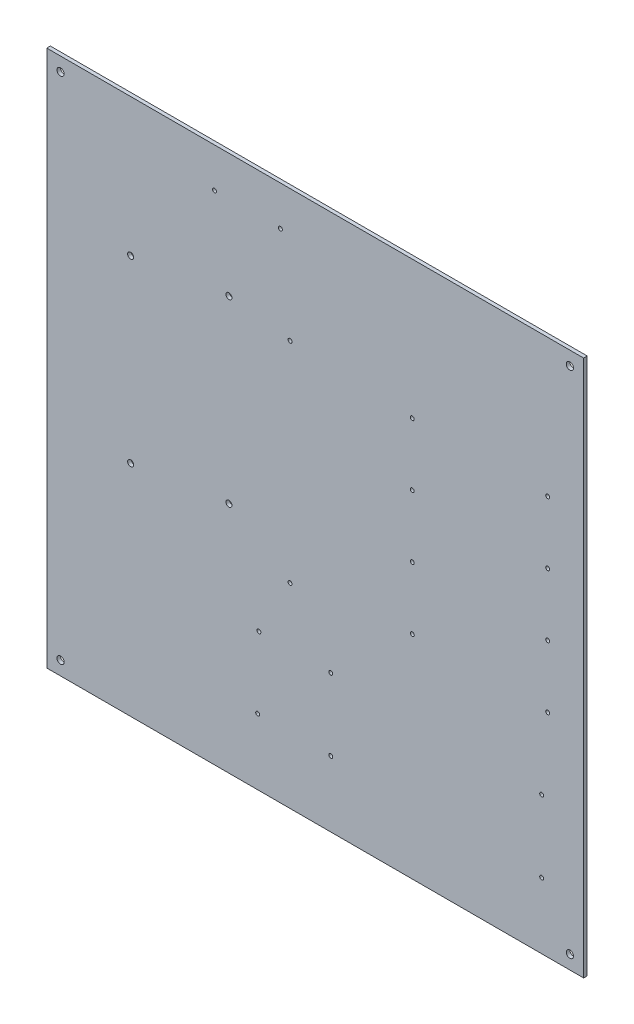
ISO-10303-21;
HEADER;
FILE_DESCRIPTION(('STEP AP214'),'2;1');
FILE_NAME('part.step','',(''),(''),'','','');
FILE_SCHEMA(('AUTOMOTIVE_DESIGN { 1 0 10303 214 1 1 1 1 }'));
ENDSEC;
DATA;
#1=APPLICATION_CONTEXT('core data for automotive mechanical design processes');
#2=APPLICATION_PROTOCOL_DEFINITION('international standard','automotive_design',2000,#1);
#3=PRODUCT_CONTEXT('',#1,'mechanical');
#4=PRODUCT('Part','Part','',(#3));
#5=PRODUCT_RELATED_PRODUCT_CATEGORY('part','',(#4));
#6=PRODUCT_DEFINITION_FORMATION('','',#4);
#7=PRODUCT_DEFINITION_CONTEXT('part definition',#1,'design');
#8=PRODUCT_DEFINITION('design','',#6,#7);
#9=PRODUCT_DEFINITION_SHAPE('','',#8);
#10=(LENGTH_UNIT() NAMED_UNIT(*) SI_UNIT(.MILLI.,.METRE.));
#11=(NAMED_UNIT(*) PLANE_ANGLE_UNIT() SI_UNIT($,.RADIAN.));
#12=(NAMED_UNIT(*) SI_UNIT($,.STERADIAN.) SOLID_ANGLE_UNIT());
#13=UNCERTAINTY_MEASURE_WITH_UNIT(LENGTH_MEASURE(1.E-05),#10,'distance_accuracy_value','');
#14=(GEOMETRIC_REPRESENTATION_CONTEXT(3) GLOBAL_UNCERTAINTY_ASSIGNED_CONTEXT((#13)) GLOBAL_UNIT_ASSIGNED_CONTEXT((#10,
#11,#12)) REPRESENTATION_CONTEXT('',''));
#15=CARTESIAN_POINT('',(0.,0.,0.));
#16=DIRECTION('',(0.,0.,1.));
#17=DIRECTION('',(1.,0.,0.));
#18=AXIS2_PLACEMENT_3D('',#15,#16,#17);
#19=CARTESIAN_POINT('',(0.,0.,-3.));
#20=DIRECTION('',(-1.,0.,0.));
#21=DIRECTION('',(0.,0.,1.));
#22=AXIS2_PLACEMENT_3D('',#19,#20,#21);
#23=PLANE('',#22);
#24=DIRECTION('',(0.,-1.,0.));
#25=VECTOR('',#24,1.);
#26=CARTESIAN_POINT('',(0.,0.,0.));
#27=LINE('',#26,#25);
#28=CARTESIAN_POINT('',(0.,448.,0.));
#29=VERTEX_POINT('',#28);
#30=CARTESIAN_POINT('',(0.,0.,0.));
#31=VERTEX_POINT('',#30);
#32=EDGE_CURVE('E98',#29,#31,#27,.T.);
#33=ORIENTED_EDGE('',*,*,#32,.F.);
#34=DIRECTION('',(0.,0.,1.));
#35=VECTOR('',#34,1.);
#36=CARTESIAN_POINT('',(0.,448.,-3.));
#37=LINE('',#36,#35);
#38=CARTESIAN_POINT('',(0.,448.,-3.));
#39=VERTEX_POINT('',#38);
#40=EDGE_CURVE('E11',#39,#29,#37,.T.);
#41=ORIENTED_EDGE('',*,*,#40,.F.);
#42=DIRECTION('',(0.,-1.,0.));
#43=VECTOR('',#42,1.);
#44=CARTESIAN_POINT('',(0.,0.,-3.));
#45=LINE('',#44,#43);
#46=CARTESIAN_POINT('',(0.,0.,-3.));
#47=VERTEX_POINT('',#46);
#48=EDGE_CURVE('E91',#39,#47,#45,.T.);
#49=ORIENTED_EDGE('',*,*,#48,.T.);
#50=DIRECTION('',(0.,0.,1.));
#51=VECTOR('',#50,1.);
#52=CARTESIAN_POINT('',(0.,0.,-3.));
#53=LINE('',#52,#51);
#54=EDGE_CURVE('E36',#47,#31,#53,.T.);
#55=ORIENTED_EDGE('',*,*,#54,.T.);
#56=EDGE_LOOP('',(#33,#41,#49,#55));
#57=FACE_BOUND('',#56,.T.);
#58=ADVANCED_FACE('F33',(#57),#23,.T.);
#59=CARTESIAN_POINT('',(0.,448.,-3.));
#60=DIRECTION('',(0.,1.,0.));
#61=DIRECTION('',(0.,0.,1.));
#62=AXIS2_PLACEMENT_3D('',#59,#60,#61);
#63=PLANE('',#62);
#64=DIRECTION('',(-1.,0.,0.));
#65=VECTOR('',#64,1.);
#66=CARTESIAN_POINT('',(0.,448.,0.));
#67=LINE('',#66,#65);
#68=CARTESIAN_POINT('',(448.,448.,0.));
#69=VERTEX_POINT('',#68);
#70=EDGE_CURVE('E93',#69,#29,#67,.T.);
#71=ORIENTED_EDGE('',*,*,#70,.F.);
#72=DIRECTION('',(0.,0.,1.));
#73=VECTOR('',#72,1.);
#74=CARTESIAN_POINT('',(448.,448.,-3.));
#75=LINE('',#74,#73);
#76=CARTESIAN_POINT('',(448.,448.,-3.));
#77=VERTEX_POINT('',#76);
#78=EDGE_CURVE('E42',#77,#69,#75,.T.);
#79=ORIENTED_EDGE('',*,*,#78,.F.);
#80=DIRECTION('',(-1.,0.,0.));
#81=VECTOR('',#80,1.);
#82=CARTESIAN_POINT('',(0.,448.,-3.));
#83=LINE('',#82,#81);
#84=EDGE_CURVE('E88',#77,#39,#83,.T.);
#85=ORIENTED_EDGE('',*,*,#84,.T.);
#86=ORIENTED_EDGE('',*,*,#40,.T.);
#87=EDGE_LOOP('',(#71,#79,#85,#86));
#88=FACE_BOUND('',#87,.T.);
#89=ADVANCED_FACE('F109',(#88),#63,.T.);
#90=CARTESIAN_POINT('',(448.,0.,-3.));
#91=DIRECTION('',(1.,0.,0.));
#92=DIRECTION('',(0.,0.,-1.));
#93=AXIS2_PLACEMENT_3D('',#90,#91,#92);
#94=PLANE('',#93);
#95=DIRECTION('',(0.,1.,0.));
#96=VECTOR('',#95,1.);
#97=CARTESIAN_POINT('',(448.,0.,0.));
#98=LINE('',#97,#96);
#99=CARTESIAN_POINT('',(448.,0.,0.));
#100=VERTEX_POINT('',#99);
#101=EDGE_CURVE('E83',#100,#69,#98,.T.);
#102=ORIENTED_EDGE('',*,*,#101,.F.);
#103=DIRECTION('',(0.,0.,1.));
#104=VECTOR('',#103,1.);
#105=CARTESIAN_POINT('',(448.,0.,-3.));
#106=LINE('',#105,#104);
#107=CARTESIAN_POINT('',(448.,0.,-3.));
#108=VERTEX_POINT('',#107);
#109=EDGE_CURVE('E78',#108,#100,#106,.T.);
#110=ORIENTED_EDGE('',*,*,#109,.F.);
#111=DIRECTION('',(0.,1.,0.));
#112=VECTOR('',#111,1.);
#113=CARTESIAN_POINT('',(448.,0.,-3.));
#114=LINE('',#113,#112);
#115=EDGE_CURVE('E81',#108,#77,#114,.T.);
#116=ORIENTED_EDGE('',*,*,#115,.T.);
#117=ORIENTED_EDGE('',*,*,#78,.T.);
#118=EDGE_LOOP('',(#102,#110,#116,#117));
#119=FACE_BOUND('',#118,.T.);
#120=ADVANCED_FACE('F80',(#119),#94,.T.);
#121=CARTESIAN_POINT('',(0.,0.,-3.));
#122=DIRECTION('',(0.,-1.,0.));
#123=DIRECTION('',(0.,0.,-1.));
#124=AXIS2_PLACEMENT_3D('',#121,#122,#123);
#125=PLANE('',#124);
#126=DIRECTION('',(1.,0.,0.));
#127=VECTOR('',#126,1.);
#128=CARTESIAN_POINT('',(0.,0.,0.));
#129=LINE('',#128,#127);
#130=EDGE_CURVE('E101',#31,#100,#129,.T.);
#131=ORIENTED_EDGE('',*,*,#130,.F.);
#132=ORIENTED_EDGE('',*,*,#54,.F.);
#133=DIRECTION('',(1.,0.,0.));
#134=VECTOR('',#133,1.);
#135=CARTESIAN_POINT('',(0.,0.,-3.));
#136=LINE('',#135,#134);
#137=EDGE_CURVE('E87',#47,#108,#136,.T.);
#138=ORIENTED_EDGE('',*,*,#137,.T.);
#139=ORIENTED_EDGE('',*,*,#109,.T.);
#140=EDGE_LOOP('',(#131,#132,#138,#139));
#141=FACE_BOUND('',#140,.T.);
#142=ADVANCED_FACE('F90',(#141),#125,.T.);
#143=CARTESIAN_POINT('',(0.,0.,-3.));
#144=DIRECTION('',(0.,0.,-1.));
#145=DIRECTION('',(-1.,0.,0.));
#146=AXIS2_PLACEMENT_3D('',#143,#144,#145);
#147=PLANE('',#146);
#148=CARTESIAN_POINT('',(413.,55.,-3.));
#149=DIRECTION('',(0.,0.,1.));
#150=DIRECTION('',(1.,0.,0.));
#151=AXIS2_PLACEMENT_3D('',#148,#149,#150);
#152=CIRCLE('',#151,1.64999999999999);
#153=CARTESIAN_POINT('',(414.65,55.,-3.));
#154=VERTEX_POINT('',#153);
#155=EDGE_CURVE('E238',#154,#154,#152,.T.);
#156=ORIENTED_EDGE('',*,*,#155,.T.);
#157=EDGE_LOOP('',(#156));
#158=FACE_BOUND('',#157,.T.);
#159=CARTESIAN_POINT('',(413.,115.,-3.));
#160=DIRECTION('',(0.,0.,1.));
#161=DIRECTION('',(1.,0.,0.));
#162=AXIS2_PLACEMENT_3D('',#159,#160,#161);
#163=CIRCLE('',#162,1.64999999999999);
#164=CARTESIAN_POINT('',(414.65,115.,-3.));
#165=VERTEX_POINT('',#164);
#166=EDGE_CURVE('E246',#165,#165,#163,.T.);
#167=ORIENTED_EDGE('',*,*,#166,.T.);
#168=EDGE_LOOP('',(#167));
#169=FACE_BOUND('',#168,.T.);
#170=CARTESIAN_POINT('',(237.,115.,-3.));
#171=DIRECTION('',(0.,0.,1.));
#172=DIRECTION('',(1.,0.,0.));
#173=AXIS2_PLACEMENT_3D('',#170,#171,#172);
#174=CIRCLE('',#173,1.65000000000002);
#175=CARTESIAN_POINT('',(238.65,115.,-3.));
#176=VERTEX_POINT('',#175);
#177=EDGE_CURVE('E252',#176,#176,#174,.T.);
#178=ORIENTED_EDGE('',*,*,#177,.T.);
#179=EDGE_LOOP('',(#178));
#180=FACE_BOUND('',#179,.T.);
#181=CARTESIAN_POINT('',(237.,55.,-3.));
#182=DIRECTION('',(0.,0.,1.));
#183=DIRECTION('',(1.,0.,0.));
#184=AXIS2_PLACEMENT_3D('',#181,#182,#183);
#185=CIRCLE('',#184,1.65000000000002);
#186=CARTESIAN_POINT('',(238.65,55.,-3.));
#187=VERTEX_POINT('',#186);
#188=EDGE_CURVE('E258',#187,#187,#185,.T.);
#189=ORIENTED_EDGE('',*,*,#188,.T.);
#190=EDGE_LOOP('',(#189));
#191=FACE_BOUND('',#190,.T.);
#192=CARTESIAN_POINT('',(176.,55.,-3.));
#193=DIRECTION('',(0.,0.,1.));
#194=DIRECTION('',(1.,0.,0.));
#195=AXIS2_PLACEMENT_3D('',#192,#193,#194);
#196=CIRCLE('',#195,1.65000000000002);
#197=CARTESIAN_POINT('',(177.65,55.,-3.));
#198=VERTEX_POINT('',#197);
#199=EDGE_CURVE('E264',#198,#198,#196,.T.);
#200=ORIENTED_EDGE('',*,*,#199,.T.);
#201=EDGE_LOOP('',(#200));
#202=FACE_BOUND('',#201,.T.);
#203=CARTESIAN_POINT('',(177.,115.,-3.));
#204=DIRECTION('',(0.,0.,1.));
#205=DIRECTION('',(1.,0.,0.));
#206=AXIS2_PLACEMENT_3D('',#203,#204,#205);
#207=CIRCLE('',#206,1.65000000000002);
#208=CARTESIAN_POINT('',(178.65,115.,-3.));
#209=VERTEX_POINT('',#208);
#210=EDGE_CURVE('E270',#209,#209,#207,.T.);
#211=ORIENTED_EDGE('',*,*,#210,.T.);
#212=EDGE_LOOP('',(#211));
#213=FACE_BOUND('',#212,.T.);
#214=CARTESIAN_POINT('',(203.,163.,-3.));
#215=DIRECTION('',(0.,0.,1.));
#216=DIRECTION('',(1.,0.,0.));
#217=AXIS2_PLACEMENT_3D('',#214,#215,#216);
#218=CIRCLE('',#217,1.65000000000002);
#219=CARTESIAN_POINT('',(204.65,163.,-3.));
#220=VERTEX_POINT('',#219);
#221=EDGE_CURVE('E276',#220,#220,#218,.T.);
#222=ORIENTED_EDGE('',*,*,#221,.T.);
#223=EDGE_LOOP('',(#222));
#224=FACE_BOUND('',#223,.T.);
#225=CARTESIAN_POINT('',(203.,338.,-3.));
#226=DIRECTION('',(0.,0.,1.));
#227=DIRECTION('',(1.,0.,0.));
#228=AXIS2_PLACEMENT_3D('',#225,#226,#227);
#229=CIRCLE('',#228,1.65000000000002);
#230=CARTESIAN_POINT('',(204.65,338.,-3.));
#231=VERTEX_POINT('',#230);
#232=EDGE_CURVE('E282',#231,#231,#229,.T.);
#233=ORIENTED_EDGE('',*,*,#232,.T.);
#234=EDGE_LOOP('',(#233));
#235=FACE_BOUND('',#234,.T.);
#236=CARTESIAN_POINT('',(152.,194.7695894105,-3.));
#237=DIRECTION('',(0.,0.,1.));
#238=DIRECTION('',(1.,0.,0.));
#239=AXIS2_PLACEMENT_3D('',#236,#237,#238);
#240=CIRCLE('',#239,2.5);
#241=CARTESIAN_POINT('',(154.5,194.7695894105,-3.));
#242=VERTEX_POINT('',#241);
#243=EDGE_CURVE('E288',#242,#242,#240,.T.);
#244=ORIENTED_EDGE('',*,*,#243,.T.);
#245=EDGE_LOOP('',(#244));
#246=FACE_BOUND('',#245,.T.);
#247=CARTESIAN_POINT('',(152.,344.7695894105,-3.));
#248=DIRECTION('',(0.,0.,1.));
#249=DIRECTION('',(1.,0.,0.));
#250=AXIS2_PLACEMENT_3D('',#247,#248,#249);
#251=CIRCLE('',#250,2.5);
#252=CARTESIAN_POINT('',(154.5,344.7695894105,-3.));
#253=VERTEX_POINT('',#252);
#254=EDGE_CURVE('E294',#253,#253,#251,.T.);
#255=ORIENTED_EDGE('',*,*,#254,.T.);
#256=EDGE_LOOP('',(#255));
#257=FACE_BOUND('',#256,.T.);
#258=CARTESIAN_POINT('',(70.,183.,-3.));
#259=DIRECTION('',(0.,0.,1.));
#260=DIRECTION('',(1.,0.,0.));
#261=AXIS2_PLACEMENT_3D('',#258,#259,#260);
#262=CIRCLE('',#261,2.5);
#263=CARTESIAN_POINT('',(72.5,183.,-3.));
#264=VERTEX_POINT('',#263);
#265=EDGE_CURVE('E300',#264,#264,#262,.T.);
#266=ORIENTED_EDGE('',*,*,#265,.T.);
#267=EDGE_LOOP('',(#266));
#268=FACE_BOUND('',#267,.T.);
#269=CARTESIAN_POINT('',(70.,333.,-3.));
#270=DIRECTION('',(0.,0.,1.));
#271=DIRECTION('',(1.,0.,0.));
#272=AXIS2_PLACEMENT_3D('',#269,#270,#271);
#273=CIRCLE('',#272,2.5);
#274=CARTESIAN_POINT('',(72.5,333.,-3.));
#275=VERTEX_POINT('',#274);
#276=EDGE_CURVE('E306',#275,#275,#273,.T.);
#277=ORIENTED_EDGE('',*,*,#276,.T.);
#278=EDGE_LOOP('',(#277));
#279=FACE_BOUND('',#278,.T.);
#280=CARTESIAN_POINT('',(195.,415.,-3.));
#281=DIRECTION('',(0.,0.,1.));
#282=DIRECTION('',(1.,0.,0.));
#283=AXIS2_PLACEMENT_3D('',#280,#281,#282);
#284=CIRCLE('',#283,1.65000000000002);
#285=CARTESIAN_POINT('',(196.65,415.,-3.));
#286=VERTEX_POINT('',#285);
#287=EDGE_CURVE('E312',#286,#286,#284,.T.);
#288=ORIENTED_EDGE('',*,*,#287,.T.);
#289=EDGE_LOOP('',(#288));
#290=FACE_BOUND('',#289,.T.);
#291=CARTESIAN_POINT('',(304.999999999999,333.,-3.));
#292=DIRECTION('',(0.,0.,1.));
#293=DIRECTION('',(1.,0.,0.));
#294=AXIS2_PLACEMENT_3D('',#291,#292,#293);
#295=CIRCLE('',#294,1.64999999999999);
#296=CARTESIAN_POINT('',(306.649999999999,333.,-3.));
#297=VERTEX_POINT('',#296);
#298=EDGE_CURVE('E318',#297,#297,#295,.T.);
#299=ORIENTED_EDGE('',*,*,#298,.T.);
#300=EDGE_LOOP('',(#299));
#301=FACE_BOUND('',#300,.T.);
#302=CARTESIAN_POINT('',(417.999999999999,333.,-3.));
#303=DIRECTION('',(0.,0.,1.));
#304=DIRECTION('',(1.,0.,0.));
#305=AXIS2_PLACEMENT_3D('',#302,#303,#304);
#306=CIRCLE('',#305,1.64999999999999);
#307=CARTESIAN_POINT('',(419.649999999999,333.,-3.));
#308=VERTEX_POINT('',#307);
#309=EDGE_CURVE('E324',#308,#308,#306,.T.);
#310=ORIENTED_EDGE('',*,*,#309,.T.);
#311=EDGE_LOOP('',(#310));
#312=FACE_BOUND('',#311,.T.);
#313=CARTESIAN_POINT('',(305.,281.,-3.));
#314=DIRECTION('',(0.,0.,1.));
#315=DIRECTION('',(1.,0.,0.));
#316=AXIS2_PLACEMENT_3D('',#313,#314,#315);
#317=CIRCLE('',#316,1.64999999999999);
#318=CARTESIAN_POINT('',(306.65,281.,-3.));
#319=VERTEX_POINT('',#318);
#320=EDGE_CURVE('E330',#319,#319,#317,.T.);
#321=ORIENTED_EDGE('',*,*,#320,.T.);
#322=EDGE_LOOP('',(#321));
#323=FACE_BOUND('',#322,.T.);
#324=CARTESIAN_POINT('',(418.,281.,-3.));
#325=DIRECTION('',(0.,0.,1.));
#326=DIRECTION('',(1.,0.,0.));
#327=AXIS2_PLACEMENT_3D('',#324,#325,#326);
#328=CIRCLE('',#327,1.64999999999999);
#329=CARTESIAN_POINT('',(419.65,281.,-3.));
#330=VERTEX_POINT('',#329);
#331=EDGE_CURVE('E336',#330,#330,#328,.T.);
#332=ORIENTED_EDGE('',*,*,#331,.T.);
#333=EDGE_LOOP('',(#332));
#334=FACE_BOUND('',#333,.T.);
#335=CARTESIAN_POINT('',(305.,229.,-3.));
#336=DIRECTION('',(0.,0.,1.));
#337=DIRECTION('',(1.,0.,0.));
#338=AXIS2_PLACEMENT_3D('',#335,#336,#337);
#339=CIRCLE('',#338,1.64999999999998);
#340=CARTESIAN_POINT('',(306.65,229.,-3.));
#341=VERTEX_POINT('',#340);
#342=EDGE_CURVE('E342',#341,#341,#339,.T.);
#343=ORIENTED_EDGE('',*,*,#342,.T.);
#344=EDGE_LOOP('',(#343));
#345=FACE_BOUND('',#344,.T.);
#346=CARTESIAN_POINT('',(418.,229.,-3.));
#347=DIRECTION('',(0.,0.,1.));
#348=DIRECTION('',(1.,0.,0.));
#349=AXIS2_PLACEMENT_3D('',#346,#347,#348);
#350=CIRCLE('',#349,1.64999999999998);
#351=CARTESIAN_POINT('',(419.65,229.,-3.));
#352=VERTEX_POINT('',#351);
#353=EDGE_CURVE('E348',#352,#352,#350,.T.);
#354=ORIENTED_EDGE('',*,*,#353,.T.);
#355=EDGE_LOOP('',(#354));
#356=FACE_BOUND('',#355,.T.);
#357=CARTESIAN_POINT('',(140.,415.,-3.));
#358=DIRECTION('',(0.,0.,1.));
#359=DIRECTION('',(1.,0.,0.));
#360=AXIS2_PLACEMENT_3D('',#357,#358,#359);
#361=CIRCLE('',#360,1.65000000000002);
#362=CARTESIAN_POINT('',(141.65,415.,-3.));
#363=VERTEX_POINT('',#362);
#364=EDGE_CURVE('E354',#363,#363,#361,.T.);
#365=ORIENTED_EDGE('',*,*,#364,.T.);
#366=EDGE_LOOP('',(#365));
#367=FACE_BOUND('',#366,.T.);
#368=CARTESIAN_POINT('',(305.,177.,-3.));
#369=DIRECTION('',(0.,0.,1.));
#370=DIRECTION('',(1.,0.,0.));
#371=AXIS2_PLACEMENT_3D('',#368,#369,#370);
#372=CIRCLE('',#371,1.64999999999998);
#373=CARTESIAN_POINT('',(306.65,177.,-3.));
#374=VERTEX_POINT('',#373);
#375=EDGE_CURVE('E360',#374,#374,#372,.T.);
#376=ORIENTED_EDGE('',*,*,#375,.T.);
#377=EDGE_LOOP('',(#376));
#378=FACE_BOUND('',#377,.T.);
#379=CARTESIAN_POINT('',(418.,177.,-3.));
#380=DIRECTION('',(0.,0.,1.));
#381=DIRECTION('',(1.,0.,0.));
#382=AXIS2_PLACEMENT_3D('',#379,#380,#381);
#383=CIRCLE('',#382,1.64999999999998);
#384=CARTESIAN_POINT('',(419.65,177.,-3.));
#385=VERTEX_POINT('',#384);
#386=EDGE_CURVE('E366',#385,#385,#383,.T.);
#387=ORIENTED_EDGE('',*,*,#386,.T.);
#388=EDGE_LOOP('',(#387));
#389=FACE_BOUND('',#388,.T.);
#390=CARTESIAN_POINT('',(436.5,11.5,-3.));
#391=DIRECTION('',(0.,0.,1.));
#392=DIRECTION('',(1.,0.,0.));
#393=AXIS2_PLACEMENT_3D('',#390,#391,#392);
#394=CIRCLE('',#393,2.99999999999999);
#395=CARTESIAN_POINT('',(439.5,11.5,-3.));
#396=VERTEX_POINT('',#395);
#397=EDGE_CURVE('E372',#396,#396,#394,.T.);
#398=ORIENTED_EDGE('',*,*,#397,.T.);
#399=EDGE_LOOP('',(#398));
#400=FACE_BOUND('',#399,.T.);
#401=CARTESIAN_POINT('',(11.5,11.5,-3.));
#402=DIRECTION('',(0.,0.,1.));
#403=DIRECTION('',(-1.,0.,0.));
#404=AXIS2_PLACEMENT_3D('',#401,#402,#403);
#405=CIRCLE('',#404,3.);
#406=CARTESIAN_POINT('',(8.5,11.5,-3.));
#407=VERTEX_POINT('',#406);
#408=EDGE_CURVE('E378',#407,#407,#405,.T.);
#409=ORIENTED_EDGE('',*,*,#408,.T.);
#410=EDGE_LOOP('',(#409));
#411=FACE_BOUND('',#410,.T.);
#412=CARTESIAN_POINT('',(436.5,436.5,-3.));
#413=DIRECTION('',(0.,0.,1.));
#414=DIRECTION('',(-1.,0.,0.));
#415=AXIS2_PLACEMENT_3D('',#412,#413,#414);
#416=CIRCLE('',#415,2.99999999999999);
#417=CARTESIAN_POINT('',(433.5,436.5,-3.));
#418=VERTEX_POINT('',#417);
#419=EDGE_CURVE('E384',#418,#418,#416,.T.);
#420=ORIENTED_EDGE('',*,*,#419,.T.);
#421=EDGE_LOOP('',(#420));
#422=FACE_BOUND('',#421,.T.);
#423=CARTESIAN_POINT('',(11.5,436.5,-3.));
#424=DIRECTION('',(0.,0.,1.));
#425=DIRECTION('',(1.,0.,0.));
#426=AXIS2_PLACEMENT_3D('',#423,#424,#425);
#427=CIRCLE('',#426,3.);
#428=CARTESIAN_POINT('',(14.5,436.5,-3.));
#429=VERTEX_POINT('',#428);
#430=EDGE_CURVE('E102',#429,#429,#427,.T.);
#431=ORIENTED_EDGE('',*,*,#430,.T.);
#432=EDGE_LOOP('',(#431));
#433=FACE_BOUND('',#432,.T.);
#434=ORIENTED_EDGE('',*,*,#48,.F.);
#435=ORIENTED_EDGE('',*,*,#84,.F.);
#436=ORIENTED_EDGE('',*,*,#115,.F.);
#437=ORIENTED_EDGE('',*,*,#137,.F.);
#438=EDGE_LOOP('',(#434,#435,#436,#437));
#439=FACE_BOUND('',#438,.T.);
#440=ADVANCED_FACE('F86',(#158,#169,#180,#191,#202,#213,#224,#235,#246,#257,#268,#279,#290,#301,
#312,#323,#334,#345,#356,#367,#378,#389,#400,#411,#422,#433,#439),#147,.T.);
#441=CARTESIAN_POINT('',(0.,0.,0.));
#442=DIRECTION('',(0.,0.,-1.));
#443=DIRECTION('',(-1.,0.,0.));
#444=AXIS2_PLACEMENT_3D('',#441,#442,#443);
#445=PLANE('',#444);
#446=CARTESIAN_POINT('',(413.,55.,0.));
#447=DIRECTION('',(0.,0.,1.));
#448=DIRECTION('',(1.,0.,0.));
#449=AXIS2_PLACEMENT_3D('',#446,#447,#448);
#450=CIRCLE('',#449,1.64999999999999);
#451=CARTESIAN_POINT('',(414.65,55.,0.));
#452=VERTEX_POINT('',#451);
#453=EDGE_CURVE('E241',#452,#452,#450,.T.);
#454=ORIENTED_EDGE('',*,*,#453,.F.);
#455=EDGE_LOOP('',(#454));
#456=FACE_BOUND('',#455,.T.);
#457=CARTESIAN_POINT('',(413.,115.,0.));
#458=DIRECTION('',(0.,0.,1.));
#459=DIRECTION('',(1.,0.,0.));
#460=AXIS2_PLACEMENT_3D('',#457,#458,#459);
#461=CIRCLE('',#460,1.64999999999999);
#462=CARTESIAN_POINT('',(414.65,115.,0.));
#463=VERTEX_POINT('',#462);
#464=EDGE_CURVE('E243',#463,#463,#461,.T.);
#465=ORIENTED_EDGE('',*,*,#464,.F.);
#466=EDGE_LOOP('',(#465));
#467=FACE_BOUND('',#466,.T.);
#468=CARTESIAN_POINT('',(237.,115.,0.));
#469=DIRECTION('',(0.,0.,1.));
#470=DIRECTION('',(1.,0.,0.));
#471=AXIS2_PLACEMENT_3D('',#468,#469,#470);
#472=CIRCLE('',#471,1.65000000000002);
#473=CARTESIAN_POINT('',(238.65,115.,0.));
#474=VERTEX_POINT('',#473);
#475=EDGE_CURVE('E249',#474,#474,#472,.T.);
#476=ORIENTED_EDGE('',*,*,#475,.F.);
#477=EDGE_LOOP('',(#476));
#478=FACE_BOUND('',#477,.T.);
#479=CARTESIAN_POINT('',(237.,55.,0.));
#480=DIRECTION('',(0.,0.,1.));
#481=DIRECTION('',(1.,0.,0.));
#482=AXIS2_PLACEMENT_3D('',#479,#480,#481);
#483=CIRCLE('',#482,1.65000000000002);
#484=CARTESIAN_POINT('',(238.65,55.,0.));
#485=VERTEX_POINT('',#484);
#486=EDGE_CURVE('E255',#485,#485,#483,.T.);
#487=ORIENTED_EDGE('',*,*,#486,.F.);
#488=EDGE_LOOP('',(#487));
#489=FACE_BOUND('',#488,.T.);
#490=CARTESIAN_POINT('',(176.,55.,0.));
#491=DIRECTION('',(0.,0.,1.));
#492=DIRECTION('',(1.,0.,0.));
#493=AXIS2_PLACEMENT_3D('',#490,#491,#492);
#494=CIRCLE('',#493,1.65000000000002);
#495=CARTESIAN_POINT('',(177.65,55.,0.));
#496=VERTEX_POINT('',#495);
#497=EDGE_CURVE('E261',#496,#496,#494,.T.);
#498=ORIENTED_EDGE('',*,*,#497,.F.);
#499=EDGE_LOOP('',(#498));
#500=FACE_BOUND('',#499,.T.);
#501=CARTESIAN_POINT('',(177.,115.,0.));
#502=DIRECTION('',(0.,0.,1.));
#503=DIRECTION('',(1.,0.,0.));
#504=AXIS2_PLACEMENT_3D('',#501,#502,#503);
#505=CIRCLE('',#504,1.65000000000002);
#506=CARTESIAN_POINT('',(178.65,115.,0.));
#507=VERTEX_POINT('',#506);
#508=EDGE_CURVE('E267',#507,#507,#505,.T.);
#509=ORIENTED_EDGE('',*,*,#508,.F.);
#510=EDGE_LOOP('',(#509));
#511=FACE_BOUND('',#510,.T.);
#512=CARTESIAN_POINT('',(203.,163.,0.));
#513=DIRECTION('',(0.,0.,1.));
#514=DIRECTION('',(1.,0.,0.));
#515=AXIS2_PLACEMENT_3D('',#512,#513,#514);
#516=CIRCLE('',#515,1.65000000000002);
#517=CARTESIAN_POINT('',(204.65,163.,0.));
#518=VERTEX_POINT('',#517);
#519=EDGE_CURVE('E273',#518,#518,#516,.T.);
#520=ORIENTED_EDGE('',*,*,#519,.F.);
#521=EDGE_LOOP('',(#520));
#522=FACE_BOUND('',#521,.T.);
#523=CARTESIAN_POINT('',(203.,338.,0.));
#524=DIRECTION('',(0.,0.,1.));
#525=DIRECTION('',(1.,0.,0.));
#526=AXIS2_PLACEMENT_3D('',#523,#524,#525);
#527=CIRCLE('',#526,1.65000000000002);
#528=CARTESIAN_POINT('',(204.65,338.,0.));
#529=VERTEX_POINT('',#528);
#530=EDGE_CURVE('E279',#529,#529,#527,.T.);
#531=ORIENTED_EDGE('',*,*,#530,.F.);
#532=EDGE_LOOP('',(#531));
#533=FACE_BOUND('',#532,.T.);
#534=CARTESIAN_POINT('',(152.,194.7695894105,0.));
#535=DIRECTION('',(0.,0.,1.));
#536=DIRECTION('',(1.,0.,0.));
#537=AXIS2_PLACEMENT_3D('',#534,#535,#536);
#538=CIRCLE('',#537,2.5);
#539=CARTESIAN_POINT('',(154.5,194.7695894105,0.));
#540=VERTEX_POINT('',#539);
#541=EDGE_CURVE('E285',#540,#540,#538,.T.);
#542=ORIENTED_EDGE('',*,*,#541,.F.);
#543=EDGE_LOOP('',(#542));
#544=FACE_BOUND('',#543,.T.);
#545=CARTESIAN_POINT('',(152.,344.7695894105,0.));
#546=DIRECTION('',(0.,0.,1.));
#547=DIRECTION('',(1.,0.,0.));
#548=AXIS2_PLACEMENT_3D('',#545,#546,#547);
#549=CIRCLE('',#548,2.5);
#550=CARTESIAN_POINT('',(154.5,344.7695894105,0.));
#551=VERTEX_POINT('',#550);
#552=EDGE_CURVE('E291',#551,#551,#549,.T.);
#553=ORIENTED_EDGE('',*,*,#552,.F.);
#554=EDGE_LOOP('',(#553));
#555=FACE_BOUND('',#554,.T.);
#556=CARTESIAN_POINT('',(70.,183.,0.));
#557=DIRECTION('',(0.,0.,1.));
#558=DIRECTION('',(1.,0.,0.));
#559=AXIS2_PLACEMENT_3D('',#556,#557,#558);
#560=CIRCLE('',#559,2.5);
#561=CARTESIAN_POINT('',(72.5,183.,0.));
#562=VERTEX_POINT('',#561);
#563=EDGE_CURVE('E297',#562,#562,#560,.T.);
#564=ORIENTED_EDGE('',*,*,#563,.F.);
#565=EDGE_LOOP('',(#564));
#566=FACE_BOUND('',#565,.T.);
#567=CARTESIAN_POINT('',(70.,333.,0.));
#568=DIRECTION('',(0.,0.,1.));
#569=DIRECTION('',(1.,0.,0.));
#570=AXIS2_PLACEMENT_3D('',#567,#568,#569);
#571=CIRCLE('',#570,2.5);
#572=CARTESIAN_POINT('',(72.5,333.,0.));
#573=VERTEX_POINT('',#572);
#574=EDGE_CURVE('E303',#573,#573,#571,.T.);
#575=ORIENTED_EDGE('',*,*,#574,.F.);
#576=EDGE_LOOP('',(#575));
#577=FACE_BOUND('',#576,.T.);
#578=CARTESIAN_POINT('',(195.,415.,0.));
#579=DIRECTION('',(0.,0.,1.));
#580=DIRECTION('',(1.,0.,0.));
#581=AXIS2_PLACEMENT_3D('',#578,#579,#580);
#582=CIRCLE('',#581,1.65000000000002);
#583=CARTESIAN_POINT('',(196.65,415.,0.));
#584=VERTEX_POINT('',#583);
#585=EDGE_CURVE('E309',#584,#584,#582,.T.);
#586=ORIENTED_EDGE('',*,*,#585,.F.);
#587=EDGE_LOOP('',(#586));
#588=FACE_BOUND('',#587,.T.);
#589=CARTESIAN_POINT('',(304.999999999999,333.,0.));
#590=DIRECTION('',(0.,0.,1.));
#591=DIRECTION('',(1.,0.,0.));
#592=AXIS2_PLACEMENT_3D('',#589,#590,#591);
#593=CIRCLE('',#592,1.64999999999999);
#594=CARTESIAN_POINT('',(306.649999999999,333.,0.));
#595=VERTEX_POINT('',#594);
#596=EDGE_CURVE('E315',#595,#595,#593,.T.);
#597=ORIENTED_EDGE('',*,*,#596,.F.);
#598=EDGE_LOOP('',(#597));
#599=FACE_BOUND('',#598,.T.);
#600=CARTESIAN_POINT('',(417.999999999999,333.,0.));
#601=DIRECTION('',(0.,0.,1.));
#602=DIRECTION('',(1.,0.,0.));
#603=AXIS2_PLACEMENT_3D('',#600,#601,#602);
#604=CIRCLE('',#603,1.64999999999999);
#605=CARTESIAN_POINT('',(419.649999999999,333.,0.));
#606=VERTEX_POINT('',#605);
#607=EDGE_CURVE('E321',#606,#606,#604,.T.);
#608=ORIENTED_EDGE('',*,*,#607,.F.);
#609=EDGE_LOOP('',(#608));
#610=FACE_BOUND('',#609,.T.);
#611=CARTESIAN_POINT('',(305.,281.,0.));
#612=DIRECTION('',(0.,0.,1.));
#613=DIRECTION('',(1.,0.,0.));
#614=AXIS2_PLACEMENT_3D('',#611,#612,#613);
#615=CIRCLE('',#614,1.64999999999999);
#616=CARTESIAN_POINT('',(306.65,281.,0.));
#617=VERTEX_POINT('',#616);
#618=EDGE_CURVE('E327',#617,#617,#615,.T.);
#619=ORIENTED_EDGE('',*,*,#618,.F.);
#620=EDGE_LOOP('',(#619));
#621=FACE_BOUND('',#620,.T.);
#622=CARTESIAN_POINT('',(418.,281.,0.));
#623=DIRECTION('',(0.,0.,1.));
#624=DIRECTION('',(1.,0.,0.));
#625=AXIS2_PLACEMENT_3D('',#622,#623,#624);
#626=CIRCLE('',#625,1.64999999999999);
#627=CARTESIAN_POINT('',(419.65,281.,0.));
#628=VERTEX_POINT('',#627);
#629=EDGE_CURVE('E333',#628,#628,#626,.T.);
#630=ORIENTED_EDGE('',*,*,#629,.F.);
#631=EDGE_LOOP('',(#630));
#632=FACE_BOUND('',#631,.T.);
#633=CARTESIAN_POINT('',(305.,229.,0.));
#634=DIRECTION('',(0.,0.,1.));
#635=DIRECTION('',(1.,0.,0.));
#636=AXIS2_PLACEMENT_3D('',#633,#634,#635);
#637=CIRCLE('',#636,1.64999999999998);
#638=CARTESIAN_POINT('',(306.65,229.,0.));
#639=VERTEX_POINT('',#638);
#640=EDGE_CURVE('E339',#639,#639,#637,.T.);
#641=ORIENTED_EDGE('',*,*,#640,.F.);
#642=EDGE_LOOP('',(#641));
#643=FACE_BOUND('',#642,.T.);
#644=CARTESIAN_POINT('',(418.,229.,0.));
#645=DIRECTION('',(0.,0.,1.));
#646=DIRECTION('',(1.,0.,0.));
#647=AXIS2_PLACEMENT_3D('',#644,#645,#646);
#648=CIRCLE('',#647,1.64999999999998);
#649=CARTESIAN_POINT('',(419.65,229.,0.));
#650=VERTEX_POINT('',#649);
#651=EDGE_CURVE('E345',#650,#650,#648,.T.);
#652=ORIENTED_EDGE('',*,*,#651,.F.);
#653=EDGE_LOOP('',(#652));
#654=FACE_BOUND('',#653,.T.);
#655=CARTESIAN_POINT('',(140.,415.,0.));
#656=DIRECTION('',(0.,0.,1.));
#657=DIRECTION('',(1.,0.,0.));
#658=AXIS2_PLACEMENT_3D('',#655,#656,#657);
#659=CIRCLE('',#658,1.65000000000002);
#660=CARTESIAN_POINT('',(141.65,415.,0.));
#661=VERTEX_POINT('',#660);
#662=EDGE_CURVE('E351',#661,#661,#659,.T.);
#663=ORIENTED_EDGE('',*,*,#662,.F.);
#664=EDGE_LOOP('',(#663));
#665=FACE_BOUND('',#664,.T.);
#666=CARTESIAN_POINT('',(305.,177.,0.));
#667=DIRECTION('',(0.,0.,1.));
#668=DIRECTION('',(1.,0.,0.));
#669=AXIS2_PLACEMENT_3D('',#666,#667,#668);
#670=CIRCLE('',#669,1.64999999999998);
#671=CARTESIAN_POINT('',(306.65,177.,0.));
#672=VERTEX_POINT('',#671);
#673=EDGE_CURVE('E357',#672,#672,#670,.T.);
#674=ORIENTED_EDGE('',*,*,#673,.F.);
#675=EDGE_LOOP('',(#674));
#676=FACE_BOUND('',#675,.T.);
#677=CARTESIAN_POINT('',(418.,177.,0.));
#678=DIRECTION('',(0.,0.,1.));
#679=DIRECTION('',(1.,0.,0.));
#680=AXIS2_PLACEMENT_3D('',#677,#678,#679);
#681=CIRCLE('',#680,1.64999999999998);
#682=CARTESIAN_POINT('',(419.65,177.,0.));
#683=VERTEX_POINT('',#682);
#684=EDGE_CURVE('E363',#683,#683,#681,.T.);
#685=ORIENTED_EDGE('',*,*,#684,.F.);
#686=EDGE_LOOP('',(#685));
#687=FACE_BOUND('',#686,.T.);
#688=CARTESIAN_POINT('',(436.5,11.5,0.));
#689=DIRECTION('',(0.,0.,1.));
#690=DIRECTION('',(1.,0.,0.));
#691=AXIS2_PLACEMENT_3D('',#688,#689,#690);
#692=CIRCLE('',#691,2.99999999999999);
#693=CARTESIAN_POINT('',(439.5,11.5,0.));
#694=VERTEX_POINT('',#693);
#695=EDGE_CURVE('E369',#694,#694,#692,.T.);
#696=ORIENTED_EDGE('',*,*,#695,.F.);
#697=EDGE_LOOP('',(#696));
#698=FACE_BOUND('',#697,.T.);
#699=CARTESIAN_POINT('',(11.5,11.5,0.));
#700=DIRECTION('',(0.,0.,1.));
#701=DIRECTION('',(-1.,0.,0.));
#702=AXIS2_PLACEMENT_3D('',#699,#700,#701);
#703=CIRCLE('',#702,3.);
#704=CARTESIAN_POINT('',(8.5,11.5,0.));
#705=VERTEX_POINT('',#704);
#706=EDGE_CURVE('E375',#705,#705,#703,.T.);
#707=ORIENTED_EDGE('',*,*,#706,.F.);
#708=EDGE_LOOP('',(#707));
#709=FACE_BOUND('',#708,.T.);
#710=CARTESIAN_POINT('',(436.5,436.5,0.));
#711=DIRECTION('',(0.,0.,1.));
#712=DIRECTION('',(-1.,0.,0.));
#713=AXIS2_PLACEMENT_3D('',#710,#711,#712);
#714=CIRCLE('',#713,2.99999999999999);
#715=CARTESIAN_POINT('',(433.5,436.5,0.));
#716=VERTEX_POINT('',#715);
#717=EDGE_CURVE('E381',#716,#716,#714,.T.);
#718=ORIENTED_EDGE('',*,*,#717,.F.);
#719=EDGE_LOOP('',(#718));
#720=FACE_BOUND('',#719,.T.);
#721=CARTESIAN_POINT('',(11.5,436.5,0.));
#722=DIRECTION('',(0.,0.,1.));
#723=DIRECTION('',(1.,0.,0.));
#724=AXIS2_PLACEMENT_3D('',#721,#722,#723);
#725=CIRCLE('',#724,3.);
#726=CARTESIAN_POINT('',(14.5,436.5,0.));
#727=VERTEX_POINT('',#726);
#728=EDGE_CURVE('E387',#727,#727,#725,.T.);
#729=ORIENTED_EDGE('',*,*,#728,.F.);
#730=EDGE_LOOP('',(#729));
#731=FACE_BOUND('',#730,.T.);
#732=ORIENTED_EDGE('',*,*,#32,.T.);
#733=ORIENTED_EDGE('',*,*,#130,.T.);
#734=ORIENTED_EDGE('',*,*,#101,.T.);
#735=ORIENTED_EDGE('',*,*,#70,.T.);
#736=EDGE_LOOP('',(#732,#733,#734,#735));
#737=FACE_BOUND('',#736,.T.);
#738=ADVANCED_FACE('F108',(#456,#467,#478,#489,#500,#511,#522,#533,#544,#555,#566,#577,#588,
#599,#610,#621,#632,#643,#654,#665,#676,#687,#698,#709,#720,#731,#737),#445,.F.);
#739=CARTESIAN_POINT('',(11.5,436.5,-3.));
#740=DIRECTION('',(0.,0.,1.));
#741=DIRECTION('',(1.,0.,0.));
#742=AXIS2_PLACEMENT_3D('',#739,#740,#741);
#743=CYLINDRICAL_SURFACE('',#742,3.);
#744=ORIENTED_EDGE('',*,*,#430,.F.);
#745=EDGE_LOOP('',(#744));
#746=FACE_BOUND('',#745,.T.);
#747=ORIENTED_EDGE('',*,*,#728,.T.);
#748=EDGE_LOOP('',(#747));
#749=FACE_BOUND('',#748,.T.);
#750=ADVANCED_FACE('F127',(#746,#749),#743,.F.);
#751=CARTESIAN_POINT('',(436.5,436.5,-3.));
#752=DIRECTION('',(0.,0.,1.));
#753=DIRECTION('',(1.,0.,0.));
#754=AXIS2_PLACEMENT_3D('',#751,#752,#753);
#755=CYLINDRICAL_SURFACE('',#754,2.99999999999999);
#756=ORIENTED_EDGE('',*,*,#419,.F.);
#757=EDGE_LOOP('',(#756));
#758=FACE_BOUND('',#757,.T.);
#759=ORIENTED_EDGE('',*,*,#717,.T.);
#760=EDGE_LOOP('',(#759));
#761=FACE_BOUND('',#760,.T.);
#762=ADVANCED_FACE('F134',(#758,#761),#755,.F.);
#763=CARTESIAN_POINT('',(11.5,11.5,-3.));
#764=DIRECTION('',(0.,0.,1.));
#765=DIRECTION('',(1.,0.,0.));
#766=AXIS2_PLACEMENT_3D('',#763,#764,#765);
#767=CYLINDRICAL_SURFACE('',#766,3.);
#768=ORIENTED_EDGE('',*,*,#408,.F.);
#769=EDGE_LOOP('',(#768));
#770=FACE_BOUND('',#769,.T.);
#771=ORIENTED_EDGE('',*,*,#706,.T.);
#772=EDGE_LOOP('',(#771));
#773=FACE_BOUND('',#772,.T.);
#774=ADVANCED_FACE('F138',(#770,#773),#767,.F.);
#775=CARTESIAN_POINT('',(436.5,11.5,-3.));
#776=DIRECTION('',(0.,0.,1.));
#777=DIRECTION('',(1.,0.,0.));
#778=AXIS2_PLACEMENT_3D('',#775,#776,#777);
#779=CYLINDRICAL_SURFACE('',#778,2.99999999999999);
#780=ORIENTED_EDGE('',*,*,#397,.F.);
#781=EDGE_LOOP('',(#780));
#782=FACE_BOUND('',#781,.T.);
#783=ORIENTED_EDGE('',*,*,#695,.T.);
#784=EDGE_LOOP('',(#783));
#785=FACE_BOUND('',#784,.T.);
#786=ADVANCED_FACE('F142',(#782,#785),#779,.F.);
#787=CARTESIAN_POINT('',(418.,177.,-3.));
#788=DIRECTION('',(0.,0.,1.));
#789=DIRECTION('',(1.,0.,0.));
#790=AXIS2_PLACEMENT_3D('',#787,#788,#789);
#791=CYLINDRICAL_SURFACE('',#790,1.64999999999998);
#792=ORIENTED_EDGE('',*,*,#386,.F.);
#793=EDGE_LOOP('',(#792));
#794=FACE_BOUND('',#793,.T.);
#795=ORIENTED_EDGE('',*,*,#684,.T.);
#796=EDGE_LOOP('',(#795));
#797=FACE_BOUND('',#796,.T.);
#798=ADVANCED_FACE('F146',(#794,#797),#791,.F.);
#799=CARTESIAN_POINT('',(305.,177.,-3.));
#800=DIRECTION('',(0.,0.,1.));
#801=DIRECTION('',(1.,0.,0.));
#802=AXIS2_PLACEMENT_3D('',#799,#800,#801);
#803=CYLINDRICAL_SURFACE('',#802,1.64999999999998);
#804=ORIENTED_EDGE('',*,*,#375,.F.);
#805=EDGE_LOOP('',(#804));
#806=FACE_BOUND('',#805,.T.);
#807=ORIENTED_EDGE('',*,*,#673,.T.);
#808=EDGE_LOOP('',(#807));
#809=FACE_BOUND('',#808,.T.);
#810=ADVANCED_FACE('F150',(#806,#809),#803,.F.);
#811=CARTESIAN_POINT('',(140.,415.,-3.));
#812=DIRECTION('',(0.,0.,1.));
#813=DIRECTION('',(1.,0.,0.));
#814=AXIS2_PLACEMENT_3D('',#811,#812,#813);
#815=CYLINDRICAL_SURFACE('',#814,1.65000000000002);
#816=ORIENTED_EDGE('',*,*,#364,.F.);
#817=EDGE_LOOP('',(#816));
#818=FACE_BOUND('',#817,.T.);
#819=ORIENTED_EDGE('',*,*,#662,.T.);
#820=EDGE_LOOP('',(#819));
#821=FACE_BOUND('',#820,.T.);
#822=ADVANCED_FACE('F154',(#818,#821),#815,.F.);
#823=CARTESIAN_POINT('',(418.,229.,-3.));
#824=DIRECTION('',(0.,0.,1.));
#825=DIRECTION('',(1.,0.,0.));
#826=AXIS2_PLACEMENT_3D('',#823,#824,#825);
#827=CYLINDRICAL_SURFACE('',#826,1.64999999999998);
#828=ORIENTED_EDGE('',*,*,#353,.F.);
#829=EDGE_LOOP('',(#828));
#830=FACE_BOUND('',#829,.T.);
#831=ORIENTED_EDGE('',*,*,#651,.T.);
#832=EDGE_LOOP('',(#831));
#833=FACE_BOUND('',#832,.T.);
#834=ADVANCED_FACE('F158',(#830,#833),#827,.F.);
#835=CARTESIAN_POINT('',(305.,229.,-3.));
#836=DIRECTION('',(0.,0.,1.));
#837=DIRECTION('',(1.,0.,0.));
#838=AXIS2_PLACEMENT_3D('',#835,#836,#837);
#839=CYLINDRICAL_SURFACE('',#838,1.64999999999998);
#840=ORIENTED_EDGE('',*,*,#342,.F.);
#841=EDGE_LOOP('',(#840));
#842=FACE_BOUND('',#841,.T.);
#843=ORIENTED_EDGE('',*,*,#640,.T.);
#844=EDGE_LOOP('',(#843));
#845=FACE_BOUND('',#844,.T.);
#846=ADVANCED_FACE('F162',(#842,#845),#839,.F.);
#847=CARTESIAN_POINT('',(418.,281.,-3.));
#848=DIRECTION('',(0.,0.,1.));
#849=DIRECTION('',(1.,0.,0.));
#850=AXIS2_PLACEMENT_3D('',#847,#848,#849);
#851=CYLINDRICAL_SURFACE('',#850,1.64999999999999);
#852=ORIENTED_EDGE('',*,*,#331,.F.);
#853=EDGE_LOOP('',(#852));
#854=FACE_BOUND('',#853,.T.);
#855=ORIENTED_EDGE('',*,*,#629,.T.);
#856=EDGE_LOOP('',(#855));
#857=FACE_BOUND('',#856,.T.);
#858=ADVANCED_FACE('F166',(#854,#857),#851,.F.);
#859=CARTESIAN_POINT('',(305.,281.,-3.));
#860=DIRECTION('',(0.,0.,1.));
#861=DIRECTION('',(1.,0.,0.));
#862=AXIS2_PLACEMENT_3D('',#859,#860,#861);
#863=CYLINDRICAL_SURFACE('',#862,1.64999999999999);
#864=ORIENTED_EDGE('',*,*,#320,.F.);
#865=EDGE_LOOP('',(#864));
#866=FACE_BOUND('',#865,.T.);
#867=ORIENTED_EDGE('',*,*,#618,.T.);
#868=EDGE_LOOP('',(#867));
#869=FACE_BOUND('',#868,.T.);
#870=ADVANCED_FACE('F170',(#866,#869),#863,.F.);
#871=CARTESIAN_POINT('',(417.999999999999,333.,-3.));
#872=DIRECTION('',(0.,0.,1.));
#873=DIRECTION('',(1.,0.,0.));
#874=AXIS2_PLACEMENT_3D('',#871,#872,#873);
#875=CYLINDRICAL_SURFACE('',#874,1.64999999999999);
#876=ORIENTED_EDGE('',*,*,#309,.F.);
#877=EDGE_LOOP('',(#876));
#878=FACE_BOUND('',#877,.T.);
#879=ORIENTED_EDGE('',*,*,#607,.T.);
#880=EDGE_LOOP('',(#879));
#881=FACE_BOUND('',#880,.T.);
#882=ADVANCED_FACE('F174',(#878,#881),#875,.F.);
#883=CARTESIAN_POINT('',(304.999999999999,333.,-3.));
#884=DIRECTION('',(0.,0.,1.));
#885=DIRECTION('',(1.,0.,0.));
#886=AXIS2_PLACEMENT_3D('',#883,#884,#885);
#887=CYLINDRICAL_SURFACE('',#886,1.64999999999999);
#888=ORIENTED_EDGE('',*,*,#298,.F.);
#889=EDGE_LOOP('',(#888));
#890=FACE_BOUND('',#889,.T.);
#891=ORIENTED_EDGE('',*,*,#596,.T.);
#892=EDGE_LOOP('',(#891));
#893=FACE_BOUND('',#892,.T.);
#894=ADVANCED_FACE('F178',(#890,#893),#887,.F.);
#895=CARTESIAN_POINT('',(195.,415.,-3.));
#896=DIRECTION('',(0.,0.,1.));
#897=DIRECTION('',(1.,0.,0.));
#898=AXIS2_PLACEMENT_3D('',#895,#896,#897);
#899=CYLINDRICAL_SURFACE('',#898,1.65000000000002);
#900=ORIENTED_EDGE('',*,*,#287,.F.);
#901=EDGE_LOOP('',(#900));
#902=FACE_BOUND('',#901,.T.);
#903=ORIENTED_EDGE('',*,*,#585,.T.);
#904=EDGE_LOOP('',(#903));
#905=FACE_BOUND('',#904,.T.);
#906=ADVANCED_FACE('F182',(#902,#905),#899,.F.);
#907=CARTESIAN_POINT('',(70.,333.,-3.));
#908=DIRECTION('',(0.,0.,1.));
#909=DIRECTION('',(1.,0.,0.));
#910=AXIS2_PLACEMENT_3D('',#907,#908,#909);
#911=CYLINDRICAL_SURFACE('',#910,2.5);
#912=ORIENTED_EDGE('',*,*,#276,.F.);
#913=EDGE_LOOP('',(#912));
#914=FACE_BOUND('',#913,.T.);
#915=ORIENTED_EDGE('',*,*,#574,.T.);
#916=EDGE_LOOP('',(#915));
#917=FACE_BOUND('',#916,.T.);
#918=ADVANCED_FACE('F186',(#914,#917),#911,.F.);
#919=CARTESIAN_POINT('',(70.,183.,-3.));
#920=DIRECTION('',(0.,0.,1.));
#921=DIRECTION('',(1.,0.,0.));
#922=AXIS2_PLACEMENT_3D('',#919,#920,#921);
#923=CYLINDRICAL_SURFACE('',#922,2.5);
#924=ORIENTED_EDGE('',*,*,#265,.F.);
#925=EDGE_LOOP('',(#924));
#926=FACE_BOUND('',#925,.T.);
#927=ORIENTED_EDGE('',*,*,#563,.T.);
#928=EDGE_LOOP('',(#927));
#929=FACE_BOUND('',#928,.T.);
#930=ADVANCED_FACE('F190',(#926,#929),#923,.F.);
#931=CARTESIAN_POINT('',(152.,344.7695894105,-3.));
#932=DIRECTION('',(0.,0.,1.));
#933=DIRECTION('',(1.,0.,0.));
#934=AXIS2_PLACEMENT_3D('',#931,#932,#933);
#935=CYLINDRICAL_SURFACE('',#934,2.5);
#936=ORIENTED_EDGE('',*,*,#254,.F.);
#937=EDGE_LOOP('',(#936));
#938=FACE_BOUND('',#937,.T.);
#939=ORIENTED_EDGE('',*,*,#552,.T.);
#940=EDGE_LOOP('',(#939));
#941=FACE_BOUND('',#940,.T.);
#942=ADVANCED_FACE('F194',(#938,#941),#935,.F.);
#943=CARTESIAN_POINT('',(152.,194.7695894105,-3.));
#944=DIRECTION('',(0.,0.,1.));
#945=DIRECTION('',(1.,0.,0.));
#946=AXIS2_PLACEMENT_3D('',#943,#944,#945);
#947=CYLINDRICAL_SURFACE('',#946,2.5);
#948=ORIENTED_EDGE('',*,*,#243,.F.);
#949=EDGE_LOOP('',(#948));
#950=FACE_BOUND('',#949,.T.);
#951=ORIENTED_EDGE('',*,*,#541,.T.);
#952=EDGE_LOOP('',(#951));
#953=FACE_BOUND('',#952,.T.);
#954=ADVANCED_FACE('F198',(#950,#953),#947,.F.);
#955=CARTESIAN_POINT('',(203.,338.,-3.));
#956=DIRECTION('',(0.,0.,1.));
#957=DIRECTION('',(1.,0.,0.));
#958=AXIS2_PLACEMENT_3D('',#955,#956,#957);
#959=CYLINDRICAL_SURFACE('',#958,1.65000000000002);
#960=ORIENTED_EDGE('',*,*,#232,.F.);
#961=EDGE_LOOP('',(#960));
#962=FACE_BOUND('',#961,.T.);
#963=ORIENTED_EDGE('',*,*,#530,.T.);
#964=EDGE_LOOP('',(#963));
#965=FACE_BOUND('',#964,.T.);
#966=ADVANCED_FACE('F202',(#962,#965),#959,.F.);
#967=CARTESIAN_POINT('',(203.,163.,-3.));
#968=DIRECTION('',(0.,0.,1.));
#969=DIRECTION('',(1.,0.,0.));
#970=AXIS2_PLACEMENT_3D('',#967,#968,#969);
#971=CYLINDRICAL_SURFACE('',#970,1.65000000000002);
#972=ORIENTED_EDGE('',*,*,#221,.F.);
#973=EDGE_LOOP('',(#972));
#974=FACE_BOUND('',#973,.T.);
#975=ORIENTED_EDGE('',*,*,#519,.T.);
#976=EDGE_LOOP('',(#975));
#977=FACE_BOUND('',#976,.T.);
#978=ADVANCED_FACE('F206',(#974,#977),#971,.F.);
#979=CARTESIAN_POINT('',(177.,115.,-3.));
#980=DIRECTION('',(0.,0.,1.));
#981=DIRECTION('',(1.,0.,0.));
#982=AXIS2_PLACEMENT_3D('',#979,#980,#981);
#983=CYLINDRICAL_SURFACE('',#982,1.65000000000002);
#984=ORIENTED_EDGE('',*,*,#210,.F.);
#985=EDGE_LOOP('',(#984));
#986=FACE_BOUND('',#985,.T.);
#987=ORIENTED_EDGE('',*,*,#508,.T.);
#988=EDGE_LOOP('',(#987));
#989=FACE_BOUND('',#988,.T.);
#990=ADVANCED_FACE('F210',(#986,#989),#983,.F.);
#991=CARTESIAN_POINT('',(176.,55.,-3.));
#992=DIRECTION('',(0.,0.,1.));
#993=DIRECTION('',(1.,0.,0.));
#994=AXIS2_PLACEMENT_3D('',#991,#992,#993);
#995=CYLINDRICAL_SURFACE('',#994,1.65000000000002);
#996=ORIENTED_EDGE('',*,*,#199,.F.);
#997=EDGE_LOOP('',(#996));
#998=FACE_BOUND('',#997,.T.);
#999=ORIENTED_EDGE('',*,*,#497,.T.);
#1000=EDGE_LOOP('',(#999));
#1001=FACE_BOUND('',#1000,.T.);
#1002=ADVANCED_FACE('F214',(#998,#1001),#995,.F.);
#1003=CARTESIAN_POINT('',(237.,55.,-3.));
#1004=DIRECTION('',(0.,0.,1.));
#1005=DIRECTION('',(1.,0.,0.));
#1006=AXIS2_PLACEMENT_3D('',#1003,#1004,#1005);
#1007=CYLINDRICAL_SURFACE('',#1006,1.65000000000002);
#1008=ORIENTED_EDGE('',*,*,#188,.F.);
#1009=EDGE_LOOP('',(#1008));
#1010=FACE_BOUND('',#1009,.T.);
#1011=ORIENTED_EDGE('',*,*,#486,.T.);
#1012=EDGE_LOOP('',(#1011));
#1013=FACE_BOUND('',#1012,.T.);
#1014=ADVANCED_FACE('F218',(#1010,#1013),#1007,.F.);
#1015=CARTESIAN_POINT('',(237.,115.,-3.));
#1016=DIRECTION('',(0.,0.,1.));
#1017=DIRECTION('',(1.,0.,0.));
#1018=AXIS2_PLACEMENT_3D('',#1015,#1016,#1017);
#1019=CYLINDRICAL_SURFACE('',#1018,1.65000000000002);
#1020=ORIENTED_EDGE('',*,*,#177,.F.);
#1021=EDGE_LOOP('',(#1020));
#1022=FACE_BOUND('',#1021,.T.);
#1023=ORIENTED_EDGE('',*,*,#475,.T.);
#1024=EDGE_LOOP('',(#1023));
#1025=FACE_BOUND('',#1024,.T.);
#1026=ADVANCED_FACE('F222',(#1022,#1025),#1019,.F.);
#1027=CARTESIAN_POINT('',(413.,115.,-3.));
#1028=DIRECTION('',(0.,0.,1.));
#1029=DIRECTION('',(1.,0.,0.));
#1030=AXIS2_PLACEMENT_3D('',#1027,#1028,#1029);
#1031=CYLINDRICAL_SURFACE('',#1030,1.64999999999999);
#1032=ORIENTED_EDGE('',*,*,#166,.F.);
#1033=EDGE_LOOP('',(#1032));
#1034=FACE_BOUND('',#1033,.T.);
#1035=ORIENTED_EDGE('',*,*,#464,.T.);
#1036=EDGE_LOOP('',(#1035));
#1037=FACE_BOUND('',#1036,.T.);
#1038=ADVANCED_FACE('F226',(#1034,#1037),#1031,.F.);
#1039=CARTESIAN_POINT('',(413.,55.,-3.));
#1040=DIRECTION('',(0.,0.,1.));
#1041=DIRECTION('',(1.,0.,0.));
#1042=AXIS2_PLACEMENT_3D('',#1039,#1040,#1041);
#1043=CYLINDRICAL_SURFACE('',#1042,1.64999999999999);
#1044=ORIENTED_EDGE('',*,*,#155,.F.);
#1045=EDGE_LOOP('',(#1044));
#1046=FACE_BOUND('',#1045,.T.);
#1047=ORIENTED_EDGE('',*,*,#453,.T.);
#1048=EDGE_LOOP('',(#1047));
#1049=FACE_BOUND('',#1048,.T.);
#1050=ADVANCED_FACE('F230',(#1046,#1049),#1043,.F.);
#1051=CLOSED_SHELL('',(#58,#89,#120,#142,#440,#738,#750,#762,#774,#786,#798,#810,#822,#834,#846,
#858,#870,#882,#894,#906,#918,#930,#942,#954,#966,#978,#990,#1002,#1014,#1026,#1038,#1050));
#1052=MANIFOLD_SOLID_BREP('B2',#1051);
#1053=ADVANCED_BREP_SHAPE_REPRESENTATION('',(#18,#1052),#14);
#1054=SHAPE_DEFINITION_REPRESENTATION(#9,#1053);
ENDSEC;
END-ISO-10303-21;
